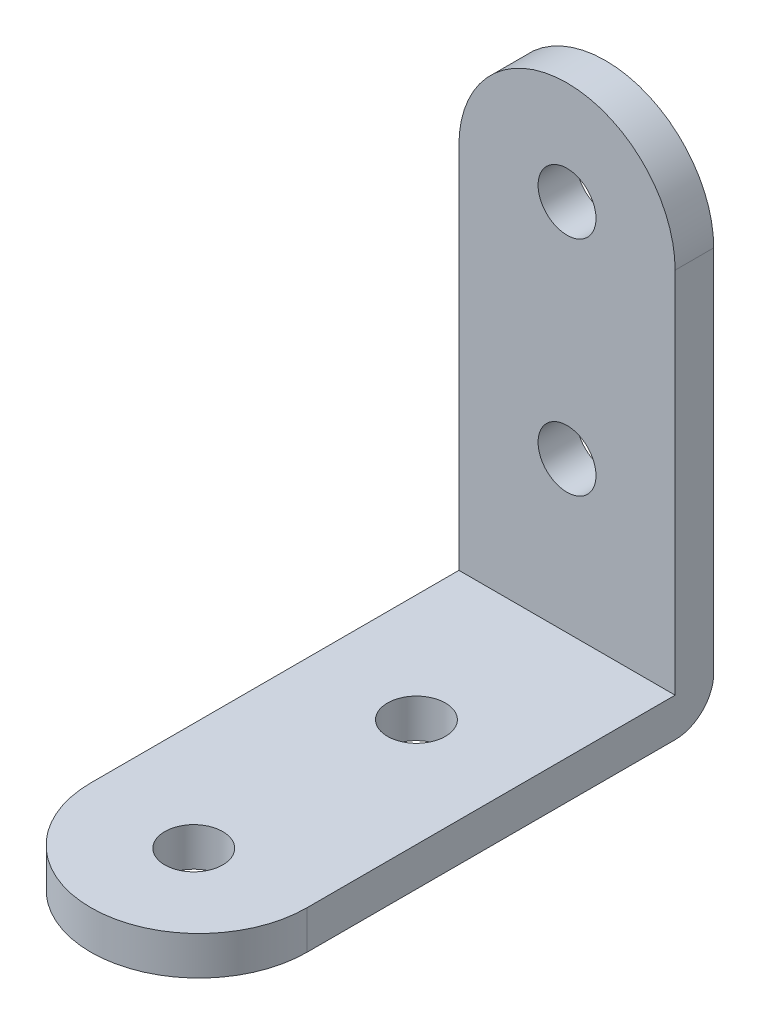
ISO-10303-21;
HEADER;
FILE_DESCRIPTION(('STEP AP214'),'2;1');
FILE_NAME('part.step','',(''),(''),'','','');
FILE_SCHEMA(('AUTOMOTIVE_DESIGN { 1 0 10303 214 1 1 1 1 }'));
ENDSEC;
DATA;
#1=APPLICATION_CONTEXT('core data for automotive mechanical design processes');
#2=APPLICATION_PROTOCOL_DEFINITION('international standard','automotive_design',2000,#1);
#3=PRODUCT_CONTEXT('',#1,'mechanical');
#4=PRODUCT('Part','Part','',(#3));
#5=PRODUCT_RELATED_PRODUCT_CATEGORY('part','',(#4));
#6=PRODUCT_DEFINITION_FORMATION('','',#4);
#7=PRODUCT_DEFINITION_CONTEXT('part definition',#1,'design');
#8=PRODUCT_DEFINITION('design','',#6,#7);
#9=PRODUCT_DEFINITION_SHAPE('','',#8);
#10=(LENGTH_UNIT() NAMED_UNIT(*) SI_UNIT(.MILLI.,.METRE.));
#11=(NAMED_UNIT(*) PLANE_ANGLE_UNIT() SI_UNIT($,.RADIAN.));
#12=(NAMED_UNIT(*) SI_UNIT($,.STERADIAN.) SOLID_ANGLE_UNIT());
#13=UNCERTAINTY_MEASURE_WITH_UNIT(LENGTH_MEASURE(1.E-05),#10,'distance_accuracy_value','');
#14=(GEOMETRIC_REPRESENTATION_CONTEXT(3) GLOBAL_UNCERTAINTY_ASSIGNED_CONTEXT((#13)) GLOBAL_UNIT_ASSIGNED_CONTEXT((#10,
#11,#12)) REPRESENTATION_CONTEXT('',''));
#15=CARTESIAN_POINT('',(0.,0.,0.));
#16=DIRECTION('',(0.,0.,1.));
#17=DIRECTION('',(1.,0.,0.));
#18=AXIS2_PLACEMENT_3D('',#15,#16,#17);
#19=CARTESIAN_POINT('',(0.,15.8,3.));
#20=DIRECTION('',(0.,0.,-1.));
#21=DIRECTION('',(-1.,0.,0.));
#22=AXIS2_PLACEMENT_3D('',#19,#20,#21);
#23=PLANE('',#22);
#24=DIRECTION('',(0.,-1.,0.));
#25=VECTOR('',#24,1.);
#26=CARTESIAN_POINT('',(-8.4,15.8,3.));
#27=LINE('',#26,#25);
#28=CARTESIAN_POINT('',(-8.4,15.8,3.));
#29=VERTEX_POINT('',#28);
#30=CARTESIAN_POINT('',(-8.4,-12.8,3.));
#31=VERTEX_POINT('',#30);
#32=EDGE_CURVE('E108',#29,#31,#27,.T.);
#33=ORIENTED_EDGE('',*,*,#32,.T.);
#34=DIRECTION('',(1.,0.,0.));
#35=VECTOR('',#34,1.);
#36=CARTESIAN_POINT('',(0.,-12.8,3.));
#37=LINE('',#36,#35);
#38=CARTESIAN_POINT('',(8.4,-12.8,3.));
#39=VERTEX_POINT('',#38);
#40=EDGE_CURVE('E123',#31,#39,#37,.T.);
#41=ORIENTED_EDGE('',*,*,#40,.T.);
#42=DIRECTION('',(0.,1.,0.));
#43=VECTOR('',#42,1.);
#44=CARTESIAN_POINT('',(8.4,15.8,3.));
#45=LINE('',#44,#43);
#46=CARTESIAN_POINT('',(8.4,15.8,3.));
#47=VERTEX_POINT('',#46);
#48=EDGE_CURVE('E142',#39,#47,#45,.T.);
#49=ORIENTED_EDGE('',*,*,#48,.T.);
#50=CARTESIAN_POINT('',(0.,15.8,3.));
#51=DIRECTION('',(0.,0.,1.));
#52=DIRECTION('',(-1.,0.,0.));
#53=AXIS2_PLACEMENT_3D('',#50,#51,#52);
#54=CIRCLE('',#53,8.4);
#55=EDGE_CURVE('E144',#47,#29,#54,.T.);
#56=ORIENTED_EDGE('',*,*,#55,.T.);
#57=EDGE_LOOP('',(#33,#41,#49,#56));
#58=FACE_BOUND('',#57,.T.);
#59=CARTESIAN_POINT('',(0.,16.2,3.));
#60=DIRECTION('',(0.,0.,1.));
#61=DIRECTION('',(1.,0.,0.));
#62=AXIS2_PLACEMENT_3D('',#59,#60,#61);
#63=CIRCLE('',#62,2.24999999999999);
#64=CARTESIAN_POINT('',(2.24999999999999,16.2,3.));
#65=VERTEX_POINT('',#64);
#66=EDGE_CURVE('E136',#65,#65,#63,.T.);
#67=ORIENTED_EDGE('',*,*,#66,.F.);
#68=EDGE_LOOP('',(#67));
#69=FACE_BOUND('',#68,.T.);
#70=CARTESIAN_POINT('',(0.,-1.1,3.));
#71=DIRECTION('',(0.,0.,1.));
#72=DIRECTION('',(1.,0.,0.));
#73=AXIS2_PLACEMENT_3D('',#70,#71,#72);
#74=CIRCLE('',#73,2.25);
#75=CARTESIAN_POINT('',(2.25,-1.1,3.));
#76=VERTEX_POINT('',#75);
#77=EDGE_CURVE('E130',#76,#76,#74,.T.);
#78=ORIENTED_EDGE('',*,*,#77,.F.);
#79=EDGE_LOOP('',(#78));
#80=FACE_BOUND('',#79,.T.);
#81=ADVANCED_FACE('F39',(#58,#69,#80),#23,.F.);
#82=CARTESIAN_POINT('',(0.,15.8,0.));
#83=DIRECTION('',(0.,0.,-1.));
#84=DIRECTION('',(-1.,0.,0.));
#85=AXIS2_PLACEMENT_3D('',#82,#83,#84);
#86=PLANE('',#85);
#87=DIRECTION('',(0.,1.,0.));
#88=VECTOR('',#87,1.);
#89=CARTESIAN_POINT('',(8.4,15.8,0.));
#90=LINE('',#89,#88);
#91=CARTESIAN_POINT('',(8.4,-12.8,0.));
#92=VERTEX_POINT('',#91);
#93=CARTESIAN_POINT('',(8.4,15.8,0.));
#94=VERTEX_POINT('',#93);
#95=EDGE_CURVE('E139',#92,#94,#90,.T.);
#96=ORIENTED_EDGE('',*,*,#95,.F.);
#97=DIRECTION('',(1.,0.,0.));
#98=VECTOR('',#97,1.);
#99=CARTESIAN_POINT('',(-8.4,-12.8,0.));
#100=LINE('',#99,#98);
#101=CARTESIAN_POINT('',(-8.4,-12.8,0.));
#102=VERTEX_POINT('',#101);
#103=EDGE_CURVE('E47',#92,#102,#100,.F.);
#104=ORIENTED_EDGE('',*,*,#103,.T.);
#105=DIRECTION('',(0.,-1.,0.));
#106=VECTOR('',#105,1.);
#107=CARTESIAN_POINT('',(-8.4,15.8,0.));
#108=LINE('',#107,#106);
#109=CARTESIAN_POINT('',(-8.4,15.8,0.));
#110=VERTEX_POINT('',#109);
#111=EDGE_CURVE('E145',#110,#102,#108,.T.);
#112=ORIENTED_EDGE('',*,*,#111,.F.);
#113=CARTESIAN_POINT('',(0.,15.8,0.));
#114=DIRECTION('',(0.,0.,1.));
#115=DIRECTION('',(-1.,0.,0.));
#116=AXIS2_PLACEMENT_3D('',#113,#114,#115);
#117=CIRCLE('',#116,8.4);
#118=EDGE_CURVE('E149',#94,#110,#117,.T.);
#119=ORIENTED_EDGE('',*,*,#118,.F.);
#120=EDGE_LOOP('',(#96,#104,#112,#119));
#121=FACE_BOUND('',#120,.T.);
#122=CARTESIAN_POINT('',(0.,16.2,0.));
#123=DIRECTION('',(0.,0.,1.));
#124=DIRECTION('',(1.,0.,0.));
#125=AXIS2_PLACEMENT_3D('',#122,#123,#124);
#126=CIRCLE('',#125,2.24999999999999);
#127=CARTESIAN_POINT('',(2.24999999999999,16.2,0.));
#128=VERTEX_POINT('',#127);
#129=EDGE_CURVE('E133',#128,#128,#126,.T.);
#130=ORIENTED_EDGE('',*,*,#129,.T.);
#131=EDGE_LOOP('',(#130));
#132=FACE_BOUND('',#131,.T.);
#133=CARTESIAN_POINT('',(0.,-1.1,0.));
#134=DIRECTION('',(0.,0.,1.));
#135=DIRECTION('',(1.,0.,0.));
#136=AXIS2_PLACEMENT_3D('',#133,#134,#135);
#137=CIRCLE('',#136,2.25);
#138=CARTESIAN_POINT('',(2.25,-1.1,0.));
#139=VERTEX_POINT('',#138);
#140=EDGE_CURVE('E125',#139,#139,#137,.T.);
#141=ORIENTED_EDGE('',*,*,#140,.T.);
#142=EDGE_LOOP('',(#141));
#143=FACE_BOUND('',#142,.T.);
#144=ADVANCED_FACE('F166',(#121,#132,#143),#86,.T.);
#145=CARTESIAN_POINT('',(8.4,15.8,3.));
#146=DIRECTION('',(-1.,0.,0.));
#147=DIRECTION('',(0.,-1.,0.));
#148=AXIS2_PLACEMENT_3D('',#145,#146,#147);
#149=PLANE('',#148);
#150=DIRECTION('',(0.,0.,-1.));
#151=VECTOR('',#150,1.);
#152=CARTESIAN_POINT('',(8.4,-15.8,3.));
#153=LINE('',#152,#151);
#154=CARTESIAN_POINT('',(8.4,-15.8000000000001,31.6));
#155=VERTEX_POINT('',#154);
#156=CARTESIAN_POINT('',(8.4,-15.8,3.));
#157=VERTEX_POINT('',#156);
#158=EDGE_CURVE('E97',#155,#157,#153,.T.);
#159=ORIENTED_EDGE('',*,*,#158,.T.);
#160=CARTESIAN_POINT('',(8.4,-12.8,3.));
#161=DIRECTION('',(-1.,0.,0.));
#162=DIRECTION('',(0.,-1.,0.));
#163=AXIS2_PLACEMENT_3D('',#160,#161,#162);
#164=CIRCLE('',#163,3.);
#165=EDGE_CURVE('E61',#157,#92,#164,.F.);
#166=ORIENTED_EDGE('',*,*,#165,.T.);
#167=ORIENTED_EDGE('',*,*,#95,.T.);
#168=DIRECTION('',(0.,0.,-1.));
#169=VECTOR('',#168,1.);
#170=CARTESIAN_POINT('',(8.4,15.8,3.));
#171=LINE('',#170,#169);
#172=EDGE_CURVE('E156',#47,#94,#171,.T.);
#173=ORIENTED_EDGE('',*,*,#172,.F.);
#174=ORIENTED_EDGE('',*,*,#48,.F.);
#175=DIRECTION('',(0.,0.,1.));
#176=VECTOR('',#175,1.);
#177=CARTESIAN_POINT('',(8.4,-12.8000000000001,31.6));
#178=LINE('',#177,#176);
#179=CARTESIAN_POINT('',(8.4,-12.8000000000001,31.6));
#180=VERTEX_POINT('',#179);
#181=EDGE_CURVE('E121',#39,#180,#178,.T.);
#182=ORIENTED_EDGE('',*,*,#181,.T.);
#183=DIRECTION('',(0.,1.,0.));
#184=VECTOR('',#183,1.);
#185=CARTESIAN_POINT('',(8.4,-15.8000000000001,31.6));
#186=LINE('',#185,#184);
#187=EDGE_CURVE('E113',#155,#180,#186,.T.);
#188=ORIENTED_EDGE('',*,*,#187,.F.);
#189=EDGE_LOOP('',(#159,#166,#167,#173,#174,#182,#188));
#190=FACE_BOUND('',#189,.T.);
#191=ADVANCED_FACE('F118',(#190),#149,.F.);
#192=CARTESIAN_POINT('',(0.,15.8,3.));
#193=DIRECTION('',(0.,0.,-1.));
#194=DIRECTION('',(-1.,0.,0.));
#195=AXIS2_PLACEMENT_3D('',#192,#193,#194);
#196=CYLINDRICAL_SURFACE('',#195,8.4);
#197=ORIENTED_EDGE('',*,*,#118,.T.);
#198=DIRECTION('',(0.,0.,-1.));
#199=VECTOR('',#198,1.);
#200=CARTESIAN_POINT('',(-8.4,15.8,3.));
#201=LINE('',#200,#199);
#202=EDGE_CURVE('E153',#29,#110,#201,.T.);
#203=ORIENTED_EDGE('',*,*,#202,.F.);
#204=ORIENTED_EDGE('',*,*,#55,.F.);
#205=ORIENTED_EDGE('',*,*,#172,.T.);
#206=EDGE_LOOP('',(#197,#203,#204,#205));
#207=FACE_BOUND('',#206,.T.);
#208=ADVANCED_FACE('F163',(#207),#196,.T.);
#209=CARTESIAN_POINT('',(-8.4,15.8,3.));
#210=DIRECTION('',(1.,0.,0.));
#211=DIRECTION('',(0.,1.,0.));
#212=AXIS2_PLACEMENT_3D('',#209,#210,#211);
#213=PLANE('',#212);
#214=ORIENTED_EDGE('',*,*,#111,.T.);
#215=CARTESIAN_POINT('',(-8.4,-12.8,3.));
#216=DIRECTION('',(1.,0.,0.));
#217=DIRECTION('',(0.,1.,0.));
#218=AXIS2_PLACEMENT_3D('',#215,#216,#217);
#219=CIRCLE('',#218,3.);
#220=CARTESIAN_POINT('',(-8.4,-15.8,3.));
#221=VERTEX_POINT('',#220);
#222=EDGE_CURVE('E11',#102,#221,#219,.F.);
#223=ORIENTED_EDGE('',*,*,#222,.T.);
#224=DIRECTION('',(0.,0.,-1.));
#225=VECTOR('',#224,1.);
#226=CARTESIAN_POINT('',(-8.4,-15.8,3.));
#227=LINE('',#226,#225);
#228=CARTESIAN_POINT('',(-8.4,-15.8000000000001,31.6));
#229=VERTEX_POINT('',#228);
#230=EDGE_CURVE('E107',#229,#221,#227,.T.);
#231=ORIENTED_EDGE('',*,*,#230,.F.);
#232=DIRECTION('',(0.,1.,0.));
#233=VECTOR('',#232,1.);
#234=CARTESIAN_POINT('',(-8.4,-15.8000000000001,31.6));
#235=LINE('',#234,#233);
#236=CARTESIAN_POINT('',(-8.4,-12.8000000000001,31.6));
#237=VERTEX_POINT('',#236);
#238=EDGE_CURVE('E115',#229,#237,#235,.T.);
#239=ORIENTED_EDGE('',*,*,#238,.T.);
#240=DIRECTION('',(0.,0.,-1.));
#241=VECTOR('',#240,1.);
#242=CARTESIAN_POINT('',(-8.4,-12.8000000000001,31.6));
#243=LINE('',#242,#241);
#244=EDGE_CURVE('E116',#237,#31,#243,.T.);
#245=ORIENTED_EDGE('',*,*,#244,.T.);
#246=ORIENTED_EDGE('',*,*,#32,.F.);
#247=ORIENTED_EDGE('',*,*,#202,.T.);
#248=EDGE_LOOP('',(#214,#223,#231,#239,#245,#246,#247));
#249=FACE_BOUND('',#248,.T.);
#250=ADVANCED_FACE('F170',(#249),#213,.F.);
#251=CARTESIAN_POINT('',(-8.4,-15.8,3.));
#252=DIRECTION('',(0.,1.,0.));
#253=DIRECTION('',(0.,0.,1.));
#254=AXIS2_PLACEMENT_3D('',#251,#252,#253);
#255=PLANE('',#254);
#256=ORIENTED_EDGE('',*,*,#230,.T.);
#257=DIRECTION('',(1.,0.,0.));
#258=VECTOR('',#257,1.);
#259=CARTESIAN_POINT('',(8.4,-15.8,3.));
#260=LINE('',#259,#258);
#261=EDGE_CURVE('E105',#221,#157,#260,.T.);
#262=ORIENTED_EDGE('',*,*,#261,.T.);
#263=ORIENTED_EDGE('',*,*,#158,.F.);
#264=CARTESIAN_POINT('',(0.,-15.8000000000001,31.6));
#265=DIRECTION('',(0.,-1.,0.));
#266=DIRECTION('',(-1.,0.,0.));
#267=AXIS2_PLACEMENT_3D('',#264,#265,#266);
#268=CIRCLE('',#267,8.4);
#269=EDGE_CURVE('E102',#155,#229,#268,.T.);
#270=ORIENTED_EDGE('',*,*,#269,.T.);
#271=EDGE_LOOP('',(#256,#262,#263,#270));
#272=FACE_BOUND('',#271,.T.);
#273=CARTESIAN_POINT('',(0.,-15.8000000000001,32.));
#274=DIRECTION('',(0.,-1.,0.));
#275=DIRECTION('',(1.,0.,0.));
#276=AXIS2_PLACEMENT_3D('',#273,#274,#275);
#277=CIRCLE('',#276,2.24999999999999);
#278=CARTESIAN_POINT('',(2.24999999999999,-15.8000000000001,32.));
#279=VERTEX_POINT('',#278);
#280=EDGE_CURVE('E299',#279,#279,#277,.T.);
#281=ORIENTED_EDGE('',*,*,#280,.F.);
#282=EDGE_LOOP('',(#281));
#283=FACE_BOUND('',#282,.T.);
#284=CARTESIAN_POINT('',(0.,-15.8000000000001,14.7));
#285=DIRECTION('',(0.,-1.,0.));
#286=DIRECTION('',(1.,0.,0.));
#287=AXIS2_PLACEMENT_3D('',#284,#285,#286);
#288=CIRCLE('',#287,2.25);
#289=CARTESIAN_POINT('',(2.25,-15.8000000000001,14.7));
#290=VERTEX_POINT('',#289);
#291=EDGE_CURVE('E304',#290,#290,#288,.T.);
#292=ORIENTED_EDGE('',*,*,#291,.F.);
#293=EDGE_LOOP('',(#292));
#294=FACE_BOUND('',#293,.T.);
#295=ADVANCED_FACE('F100',(#272,#283,#294),#255,.F.);
#296=CARTESIAN_POINT('',(0.,16.2,3.));
#297=DIRECTION('',(0.,0.,-1.));
#298=DIRECTION('',(-1.,0.,0.));
#299=AXIS2_PLACEMENT_3D('',#296,#297,#298);
#300=CYLINDRICAL_SURFACE('',#299,2.24999999999999);
#301=ORIENTED_EDGE('',*,*,#66,.T.);
#302=EDGE_LOOP('',(#301));
#303=FACE_BOUND('',#302,.T.);
#304=ORIENTED_EDGE('',*,*,#129,.F.);
#305=EDGE_LOOP('',(#304));
#306=FACE_BOUND('',#305,.T.);
#307=ADVANCED_FACE('F190',(#303,#306),#300,.F.);
#308=CARTESIAN_POINT('',(0.,-1.1,3.));
#309=DIRECTION('',(0.,0.,-1.));
#310=DIRECTION('',(-1.,0.,0.));
#311=AXIS2_PLACEMENT_3D('',#308,#309,#310);
#312=CYLINDRICAL_SURFACE('',#311,2.25);
#313=ORIENTED_EDGE('',*,*,#77,.T.);
#314=EDGE_LOOP('',(#313));
#315=FACE_BOUND('',#314,.T.);
#316=ORIENTED_EDGE('',*,*,#140,.F.);
#317=EDGE_LOOP('',(#316));
#318=FACE_BOUND('',#317,.T.);
#319=ADVANCED_FACE('F221',(#315,#318),#312,.F.);
#320=CARTESIAN_POINT('',(0.,-12.8000000000001,31.6));
#321=DIRECTION('',(0.,1.,0.));
#322=DIRECTION('',(-1.,0.,0.));
#323=AXIS2_PLACEMENT_3D('',#320,#321,#322);
#324=PLANE('',#323);
#325=CARTESIAN_POINT('',(0.,-12.8000000000001,14.7));
#326=DIRECTION('',(0.,-1.,0.));
#327=DIRECTION('',(1.,0.,0.));
#328=AXIS2_PLACEMENT_3D('',#325,#326,#327);
#329=CIRCLE('',#328,2.25);
#330=CARTESIAN_POINT('',(2.25,-12.8000000000001,14.7));
#331=VERTEX_POINT('',#330);
#332=EDGE_CURVE('E308',#331,#331,#329,.T.);
#333=ORIENTED_EDGE('',*,*,#332,.T.);
#334=EDGE_LOOP('',(#333));
#335=FACE_BOUND('',#334,.T.);
#336=CARTESIAN_POINT('',(0.,-12.8000000000001,32.));
#337=DIRECTION('',(0.,-1.,0.));
#338=DIRECTION('',(1.,0.,0.));
#339=AXIS2_PLACEMENT_3D('',#336,#337,#338);
#340=CIRCLE('',#339,2.24999999999999);
#341=CARTESIAN_POINT('',(2.24999999999999,-12.8000000000001,32.));
#342=VERTEX_POINT('',#341);
#343=EDGE_CURVE('E302',#342,#342,#340,.T.);
#344=ORIENTED_EDGE('',*,*,#343,.T.);
#345=EDGE_LOOP('',(#344));
#346=FACE_BOUND('',#345,.T.);
#347=ORIENTED_EDGE('',*,*,#40,.F.);
#348=ORIENTED_EDGE('',*,*,#244,.F.);
#349=CARTESIAN_POINT('',(0.,-12.8000000000001,31.6));
#350=DIRECTION('',(0.,-1.,0.));
#351=DIRECTION('',(-1.,0.,0.));
#352=AXIS2_PLACEMENT_3D('',#349,#350,#351);
#353=CIRCLE('',#352,8.4);
#354=EDGE_CURVE('E313',#180,#237,#353,.T.);
#355=ORIENTED_EDGE('',*,*,#354,.F.);
#356=ORIENTED_EDGE('',*,*,#181,.F.);
#357=EDGE_LOOP('',(#347,#348,#355,#356));
#358=FACE_BOUND('',#357,.T.);
#359=ADVANCED_FACE('F228',(#335,#346,#358),#324,.T.);
#360=CARTESIAN_POINT('',(0.,-15.8000000000001,31.6));
#361=DIRECTION('',(0.,1.,0.));
#362=DIRECTION('',(0.,0.,1.));
#363=AXIS2_PLACEMENT_3D('',#360,#361,#362);
#364=CYLINDRICAL_SURFACE('',#363,8.4);
#365=ORIENTED_EDGE('',*,*,#354,.T.);
#366=ORIENTED_EDGE('',*,*,#238,.F.);
#367=ORIENTED_EDGE('',*,*,#269,.F.);
#368=ORIENTED_EDGE('',*,*,#187,.T.);
#369=EDGE_LOOP('',(#365,#366,#367,#368));
#370=FACE_BOUND('',#369,.T.);
#371=ADVANCED_FACE('F112',(#370),#364,.T.);
#372=CARTESIAN_POINT('',(0.,-15.8000000000001,32.));
#373=DIRECTION('',(0.,1.,0.));
#374=DIRECTION('',(0.,0.,1.));
#375=AXIS2_PLACEMENT_3D('',#372,#373,#374);
#376=CYLINDRICAL_SURFACE('',#375,2.24999999999999);
#377=ORIENTED_EDGE('',*,*,#280,.T.);
#378=EDGE_LOOP('',(#377));
#379=FACE_BOUND('',#378,.T.);
#380=ORIENTED_EDGE('',*,*,#343,.F.);
#381=EDGE_LOOP('',(#380));
#382=FACE_BOUND('',#381,.T.);
#383=ADVANCED_FACE('F178',(#379,#382),#376,.F.);
#384=CARTESIAN_POINT('',(0.,-15.8000000000001,14.7));
#385=DIRECTION('',(0.,1.,0.));
#386=DIRECTION('',(0.,0.,1.));
#387=AXIS2_PLACEMENT_3D('',#384,#385,#386);
#388=CYLINDRICAL_SURFACE('',#387,2.25);
#389=ORIENTED_EDGE('',*,*,#291,.T.);
#390=EDGE_LOOP('',(#389));
#391=FACE_BOUND('',#390,.T.);
#392=ORIENTED_EDGE('',*,*,#332,.F.);
#393=EDGE_LOOP('',(#392));
#394=FACE_BOUND('',#393,.T.);
#395=ADVANCED_FACE('F174',(#391,#394),#388,.F.);
#396=CARTESIAN_POINT('',(-8.4,-12.8,3.));
#397=DIRECTION('',(-1.,0.,0.));
#398=DIRECTION('',(0.,0.,1.));
#399=AXIS2_PLACEMENT_3D('',#396,#397,#398);
#400=CYLINDRICAL_SURFACE('',#399,3.);
#401=ORIENTED_EDGE('',*,*,#222,.F.);
#402=ORIENTED_EDGE('',*,*,#103,.F.);
#403=ORIENTED_EDGE('',*,*,#165,.F.);
#404=ORIENTED_EDGE('',*,*,#261,.F.);
#405=EDGE_LOOP('',(#401,#402,#403,#404));
#406=FACE_BOUND('',#405,.T.);
#407=ADVANCED_FACE('F41',(#406),#400,.T.);
#408=CLOSED_SHELL('',(#81,#144,#191,#208,#250,#295,#307,#319,#359,#371,#383,#395,#407));
#409=MANIFOLD_SOLID_BREP('B2',#408);
#410=ADVANCED_BREP_SHAPE_REPRESENTATION('',(#18,#409),#14);
#411=SHAPE_DEFINITION_REPRESENTATION(#9,#410);
ENDSEC;
END-ISO-10303-21;
